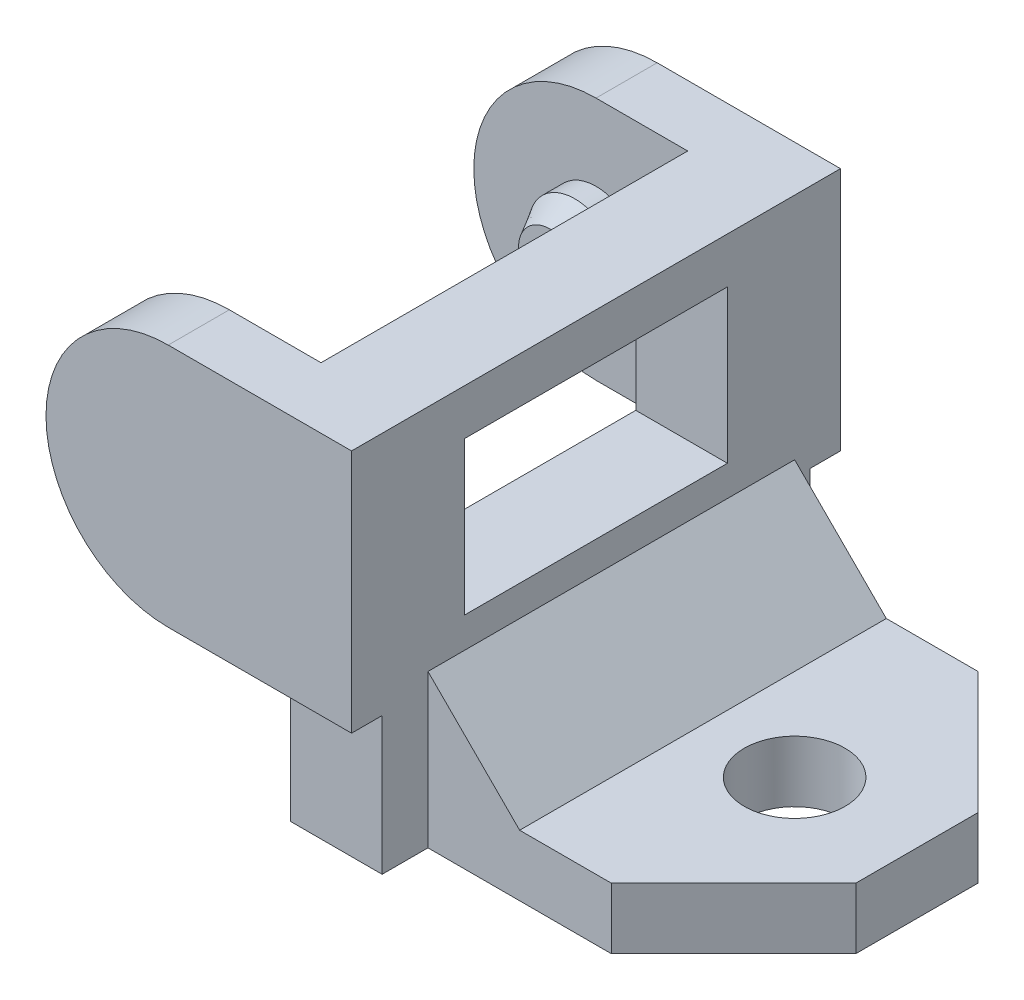
ISO-10303-21;
HEADER;
FILE_DESCRIPTION(('STEP AP214'),'2;1');
FILE_NAME('part.step','',(''),(''),'','','');
FILE_SCHEMA(('AUTOMOTIVE_DESIGN { 1 0 10303 214 1 1 1 1 }'));
ENDSEC;
DATA;
#1=APPLICATION_CONTEXT('core data for automotive mechanical design processes');
#2=APPLICATION_PROTOCOL_DEFINITION('international standard','automotive_design',2000,#1);
#3=PRODUCT_CONTEXT('',#1,'mechanical');
#4=PRODUCT('Part','Part','',(#3));
#5=PRODUCT_RELATED_PRODUCT_CATEGORY('part','',(#4));
#6=PRODUCT_DEFINITION_FORMATION('','',#4);
#7=PRODUCT_DEFINITION_CONTEXT('part definition',#1,'design');
#8=PRODUCT_DEFINITION('design','',#6,#7);
#9=PRODUCT_DEFINITION_SHAPE('','',#8);
#10=(LENGTH_UNIT() NAMED_UNIT(*) SI_UNIT(.MILLI.,.METRE.));
#11=(NAMED_UNIT(*) PLANE_ANGLE_UNIT() SI_UNIT($,.RADIAN.));
#12=(NAMED_UNIT(*) SI_UNIT($,.STERADIAN.) SOLID_ANGLE_UNIT());
#13=UNCERTAINTY_MEASURE_WITH_UNIT(LENGTH_MEASURE(1.E-05),#10,'distance_accuracy_value','');
#14=(GEOMETRIC_REPRESENTATION_CONTEXT(3) GLOBAL_UNCERTAINTY_ASSIGNED_CONTEXT((#13)) GLOBAL_UNIT_ASSIGNED_CONTEXT((#10,
#11,#12)) REPRESENTATION_CONTEXT('',''));
#15=CARTESIAN_POINT('',(0.,0.,0.));
#16=DIRECTION('',(0.,0.,1.));
#17=DIRECTION('',(1.,0.,0.));
#18=AXIS2_PLACEMENT_3D('',#15,#16,#17);
#19=CARTESIAN_POINT('',(2.,-8.,8.));
#20=DIRECTION('',(0.,1.,0.));
#21=DIRECTION('',(0.,0.,1.));
#22=AXIS2_PLACEMENT_3D('',#19,#20,#21);
#23=PLANE('',#22);
#24=DIRECTION('',(0.,0.,-1.));
#25=VECTOR('',#24,1.);
#26=CARTESIAN_POINT('',(-3.,-8.,7.));
#27=LINE('',#26,#25);
#28=CARTESIAN_POINT('',(-3.,-8.,7.));
#29=VERTEX_POINT('',#28);
#30=CARTESIAN_POINT('',(-3.,-8.,6.));
#31=VERTEX_POINT('',#30);
#32=EDGE_CURVE('E264',#29,#31,#27,.T.);
#33=ORIENTED_EDGE('',*,*,#32,.F.);
#34=DIRECTION('',(-1.,0.,0.));
#35=VECTOR('',#34,1.);
#36=CARTESIAN_POINT('',(0.,-8.,7.));
#37=LINE('',#36,#35);
#38=CARTESIAN_POINT('',(0.,-8.,7.));
#39=VERTEX_POINT('',#38);
#40=EDGE_CURVE('E237',#39,#29,#37,.T.);
#41=ORIENTED_EDGE('',*,*,#40,.F.);
#42=DIRECTION('',(0.,0.,1.));
#43=VECTOR('',#42,1.);
#44=CARTESIAN_POINT('',(0.,-8.,0.));
#45=LINE('',#44,#43);
#46=CARTESIAN_POINT('',(0.,-8.,8.));
#47=VERTEX_POINT('',#46);
#48=EDGE_CURVE('E307',#39,#47,#45,.T.);
#49=ORIENTED_EDGE('',*,*,#48,.T.);
#50=DIRECTION('',(1.,0.,0.));
#51=VECTOR('',#50,1.);
#52=CARTESIAN_POINT('',(2.,-8.,8.));
#53=LINE('',#52,#51);
#54=CARTESIAN_POINT('',(-6.,-8.,8.));
#55=VERTEX_POINT('',#54);
#56=EDGE_CURVE('E329',#55,#47,#53,.T.);
#57=ORIENTED_EDGE('',*,*,#56,.F.);
#58=DIRECTION('',(0.,0.,-1.));
#59=VECTOR('',#58,1.);
#60=CARTESIAN_POINT('',(-6.,-8.,8.));
#61=LINE('',#60,#59);
#62=CARTESIAN_POINT('',(-6.,-8.,6.));
#63=VERTEX_POINT('',#62);
#64=EDGE_CURVE('E346',#55,#63,#61,.T.);
#65=ORIENTED_EDGE('',*,*,#64,.T.);
#66=DIRECTION('',(-1.,0.,0.));
#67=VECTOR('',#66,1.);
#68=CARTESIAN_POINT('',(0.,-8.,6.));
#69=LINE('',#68,#67);
#70=EDGE_CURVE('E313',#31,#63,#69,.T.);
#71=ORIENTED_EDGE('',*,*,#70,.F.);
#72=EDGE_LOOP('',(#33,#41,#49,#57,#65,#71));
#73=FACE_BOUND('',#72,.T.);
#74=ADVANCED_FACE('F32',(#73),#23,.F.);
#75=CARTESIAN_POINT('',(-3.,-8.,-6.));
#76=VERTEX_POINT('',#75);
#77=CARTESIAN_POINT('',(-3.,-8.,-7.));
#78=VERTEX_POINT('',#77);
#79=EDGE_CURVE('E263',#76,#78,#27,.T.);
#80=ORIENTED_EDGE('',*,*,#79,.F.);
#81=DIRECTION('',(1.,0.,0.));
#82=VECTOR('',#81,1.);
#83=CARTESIAN_POINT('',(0.,-8.,-6.));
#84=LINE('',#83,#82);
#85=CARTESIAN_POINT('',(-6.,-8.,-6.));
#86=VERTEX_POINT('',#85);
#87=EDGE_CURVE('E310',#86,#76,#84,.T.);
#88=ORIENTED_EDGE('',*,*,#87,.F.);
#89=CARTESIAN_POINT('',(-6.,-8.,-8.));
#90=VERTEX_POINT('',#89);
#91=EDGE_CURVE('E345',#86,#90,#61,.T.);
#92=ORIENTED_EDGE('',*,*,#91,.T.);
#93=DIRECTION('',(1.,0.,0.));
#94=VECTOR('',#93,1.);
#95=CARTESIAN_POINT('',(2.,-8.,-8.));
#96=LINE('',#95,#94);
#97=CARTESIAN_POINT('',(0.,-8.,-8.));
#98=VERTEX_POINT('',#97);
#99=EDGE_CURVE('E338',#90,#98,#96,.T.);
#100=ORIENTED_EDGE('',*,*,#99,.T.);
#101=CARTESIAN_POINT('',(0.,-8.,-7.));
#102=VERTEX_POINT('',#101);
#103=EDGE_CURVE('E308',#98,#102,#45,.T.);
#104=ORIENTED_EDGE('',*,*,#103,.T.);
#105=DIRECTION('',(-1.,0.,0.));
#106=VECTOR('',#105,1.);
#107=CARTESIAN_POINT('',(0.,-8.,-7.));
#108=LINE('',#107,#106);
#109=EDGE_CURVE('E250',#102,#78,#108,.T.);
#110=ORIENTED_EDGE('',*,*,#109,.T.);
#111=EDGE_LOOP('',(#80,#88,#92,#100,#104,#110));
#112=FACE_BOUND('',#111,.T.);
#113=ADVANCED_FACE('F422',(#112),#23,.F.);
#114=CARTESIAN_POINT('',(-6.,-4.,8.));
#115=DIRECTION('',(0.,0.,-1.));
#116=DIRECTION('',(-1.,0.,0.));
#117=AXIS2_PLACEMENT_3D('',#114,#115,#116);
#118=CYLINDRICAL_SURFACE('',#117,4.);
#119=CARTESIAN_POINT('',(-6.,-4.,-6.));
#120=DIRECTION('',(0.,0.,1.));
#121=DIRECTION('',(1.,0.,0.));
#122=AXIS2_PLACEMENT_3D('',#119,#120,#121);
#123=CIRCLE('',#122,4.);
#124=CARTESIAN_POINT('',(-6.,0.,-6.));
#125=VERTEX_POINT('',#124);
#126=EDGE_CURVE('E323',#125,#86,#123,.T.);
#127=ORIENTED_EDGE('',*,*,#126,.F.);
#128=DIRECTION('',(0.,0.,-1.));
#129=VECTOR('',#128,1.);
#130=CARTESIAN_POINT('',(-6.,0.,8.));
#131=LINE('',#130,#129);
#132=CARTESIAN_POINT('',(-6.,0.,-8.));
#133=VERTEX_POINT('',#132);
#134=EDGE_CURVE('E335',#125,#133,#131,.T.);
#135=ORIENTED_EDGE('',*,*,#134,.T.);
#136=CARTESIAN_POINT('',(-6.,-4.,-8.));
#137=DIRECTION('',(0.,0.,1.));
#138=DIRECTION('',(1.,0.,0.));
#139=AXIS2_PLACEMENT_3D('',#136,#137,#138);
#140=CIRCLE('',#139,4.);
#141=EDGE_CURVE('E325',#133,#90,#140,.T.);
#142=ORIENTED_EDGE('',*,*,#141,.T.);
#143=ORIENTED_EDGE('',*,*,#91,.F.);
#144=EDGE_LOOP('',(#127,#135,#142,#143));
#145=FACE_BOUND('',#144,.T.);
#146=ADVANCED_FACE('F426',(#145),#118,.T.);
#147=CARTESIAN_POINT('',(-6.,0.,8.));
#148=VERTEX_POINT('',#147);
#149=CARTESIAN_POINT('',(-6.,0.,6.));
#150=VERTEX_POINT('',#149);
#151=EDGE_CURVE('E342',#148,#150,#131,.T.);
#152=ORIENTED_EDGE('',*,*,#151,.T.);
#153=CARTESIAN_POINT('',(-6.,-4.,6.));
#154=DIRECTION('',(0.,0.,-1.));
#155=DIRECTION('',(-1.,0.,0.));
#156=AXIS2_PLACEMENT_3D('',#153,#154,#155);
#157=CIRCLE('',#156,4.);
#158=EDGE_CURVE('E319',#63,#150,#157,.T.);
#159=ORIENTED_EDGE('',*,*,#158,.F.);
#160=ORIENTED_EDGE('',*,*,#64,.F.);
#161=CARTESIAN_POINT('',(-6.,-4.,8.));
#162=DIRECTION('',(0.,0.,1.));
#163=DIRECTION('',(1.,0.,0.));
#164=AXIS2_PLACEMENT_3D('',#161,#162,#163);
#165=CIRCLE('',#164,4.);
#166=EDGE_CURVE('E326',#148,#55,#165,.T.);
#167=ORIENTED_EDGE('',*,*,#166,.F.);
#168=EDGE_LOOP('',(#152,#159,#160,#167));
#169=FACE_BOUND('',#168,.T.);
#170=ADVANCED_FACE('F447',(#169),#118,.T.);
#171=CARTESIAN_POINT('',(-6.,0.,8.));
#172=DIRECTION('',(0.,-1.,0.));
#173=DIRECTION('',(1.,0.,0.));
#174=AXIS2_PLACEMENT_3D('',#171,#172,#173);
#175=PLANE('',#174);
#176=DIRECTION('',(-1.,0.,0.));
#177=VECTOR('',#176,1.);
#178=CARTESIAN_POINT('',(-6.,0.,8.));
#179=LINE('',#178,#177);
#180=CARTESIAN_POINT('',(0.,0.,8.));
#181=VERTEX_POINT('',#180);
#182=EDGE_CURVE('E333',#181,#148,#179,.T.);
#183=ORIENTED_EDGE('',*,*,#182,.F.);
#184=DIRECTION('',(0.,0.,-1.));
#185=VECTOR('',#184,1.);
#186=CARTESIAN_POINT('',(0.,0.,8.));
#187=LINE('',#186,#185);
#188=CARTESIAN_POINT('',(0.,0.,-8.));
#189=VERTEX_POINT('',#188);
#190=EDGE_CURVE('E356',#181,#189,#187,.T.);
#191=ORIENTED_EDGE('',*,*,#190,.T.);
#192=DIRECTION('',(-1.,0.,0.));
#193=VECTOR('',#192,1.);
#194=CARTESIAN_POINT('',(-6.,0.,-8.));
#195=LINE('',#194,#193);
#196=EDGE_CURVE('E330',#189,#133,#195,.T.);
#197=ORIENTED_EDGE('',*,*,#196,.T.);
#198=ORIENTED_EDGE('',*,*,#134,.F.);
#199=DIRECTION('',(-1.,0.,0.));
#200=VECTOR('',#199,1.);
#201=CARTESIAN_POINT('',(-6.,0.,-6.));
#202=LINE('',#201,#200);
#203=CARTESIAN_POINT('',(-3.,0.,-6.));
#204=VERTEX_POINT('',#203);
#205=EDGE_CURVE('E353',#204,#125,#202,.T.);
#206=ORIENTED_EDGE('',*,*,#205,.F.);
#207=DIRECTION('',(0.,0.,-1.));
#208=VECTOR('',#207,1.);
#209=CARTESIAN_POINT('',(-3.,0.,8.));
#210=LINE('',#209,#208);
#211=CARTESIAN_POINT('',(-3.,0.,6.));
#212=VERTEX_POINT('',#211);
#213=EDGE_CURVE('E351',#212,#204,#210,.T.);
#214=ORIENTED_EDGE('',*,*,#213,.F.);
#215=DIRECTION('',(1.,0.,0.));
#216=VECTOR('',#215,1.);
#217=CARTESIAN_POINT('',(-6.,0.,6.));
#218=LINE('',#217,#216);
#219=EDGE_CURVE('E349',#150,#212,#218,.T.);
#220=ORIENTED_EDGE('',*,*,#219,.F.);
#221=ORIENTED_EDGE('',*,*,#151,.F.);
#222=EDGE_LOOP('',(#183,#191,#197,#198,#206,#214,#220,#221));
#223=FACE_BOUND('',#222,.T.);
#224=ADVANCED_FACE('F432',(#223),#175,.F.);
#225=CARTESIAN_POINT('',(-6.,-4.,8.));
#226=DIRECTION('',(0.,0.,1.));
#227=DIRECTION('',(1.,0.,0.));
#228=AXIS2_PLACEMENT_3D('',#225,#226,#227);
#229=PLANE('',#228);
#230=DIRECTION('',(0.,1.,0.));
#231=VECTOR('',#230,1.);
#232=CARTESIAN_POINT('',(0.,-10.,8.));
#233=LINE('',#232,#231);
#234=EDGE_CURVE('E267',#47,#181,#233,.T.);
#235=ORIENTED_EDGE('',*,*,#234,.T.);
#236=ORIENTED_EDGE('',*,*,#182,.T.);
#237=ORIENTED_EDGE('',*,*,#166,.T.);
#238=ORIENTED_EDGE('',*,*,#56,.T.);
#239=EDGE_LOOP('',(#235,#236,#237,#238));
#240=FACE_BOUND('',#239,.T.);
#241=ADVANCED_FACE('F437',(#240),#229,.T.);
#242=CARTESIAN_POINT('',(-6.,-4.,-8.));
#243=DIRECTION('',(0.,0.,1.));
#244=DIRECTION('',(1.,0.,0.));
#245=AXIS2_PLACEMENT_3D('',#242,#243,#244);
#246=PLANE('',#245);
#247=ORIENTED_EDGE('',*,*,#196,.F.);
#248=DIRECTION('',(0.,1.,0.));
#249=VECTOR('',#248,1.);
#250=CARTESIAN_POINT('',(0.,-10.,-8.));
#251=LINE('',#250,#249);
#252=EDGE_CURVE('E268',#98,#189,#251,.T.);
#253=ORIENTED_EDGE('',*,*,#252,.F.);
#254=ORIENTED_EDGE('',*,*,#99,.F.);
#255=ORIENTED_EDGE('',*,*,#141,.F.);
#256=EDGE_LOOP('',(#247,#253,#254,#255));
#257=FACE_BOUND('',#256,.T.);
#258=ADVANCED_FACE('F420',(#257),#246,.F.);
#259=CARTESIAN_POINT('',(0.,-8.,-6.));
#260=DIRECTION('',(0.,0.,1.));
#261=DIRECTION('',(1.,0.,0.));
#262=AXIS2_PLACEMENT_3D('',#259,#260,#261);
#263=PLANE('',#262);
#264=CARTESIAN_POINT('',(-6.,-4.,-6.));
#265=DIRECTION('',(0.,0.,1.));
#266=DIRECTION('',(1.,0.,0.));
#267=AXIS2_PLACEMENT_3D('',#264,#265,#266);
#268=CIRCLE('',#267,1.5);
#269=CARTESIAN_POINT('',(-4.5,-4.,-6.));
#270=VERTEX_POINT('',#269);
#271=EDGE_CURVE('E358',#270,#270,#268,.T.);
#272=ORIENTED_EDGE('',*,*,#271,.F.);
#273=EDGE_LOOP('',(#272));
#274=FACE_BOUND('',#273,.T.);
#275=ORIENTED_EDGE('',*,*,#126,.T.);
#276=ORIENTED_EDGE('',*,*,#87,.T.);
#277=DIRECTION('',(0.,1.,0.));
#278=VECTOR('',#277,1.);
#279=CARTESIAN_POINT('',(-3.,-8.,-6.));
#280=LINE('',#279,#278);
#281=EDGE_CURVE('E316',#76,#204,#280,.T.);
#282=ORIENTED_EDGE('',*,*,#281,.T.);
#283=ORIENTED_EDGE('',*,*,#205,.T.);
#284=EDGE_LOOP('',(#275,#276,#282,#283));
#285=FACE_BOUND('',#284,.T.);
#286=ADVANCED_FACE('F459',(#274,#285),#263,.T.);
#287=CARTESIAN_POINT('',(-3.,-8.,0.));
#288=DIRECTION('',(-1.,0.,0.));
#289=DIRECTION('',(0.,0.,1.));
#290=AXIS2_PLACEMENT_3D('',#287,#288,#289);
#291=PLANE('',#290);
#292=DIRECTION('',(0.,1.,0.));
#293=VECTOR('',#292,1.);
#294=CARTESIAN_POINT('',(-3.,-8.,4.3));
#295=LINE('',#294,#293);
#296=CARTESIAN_POINT('',(-3.,-6.5,4.3));
#297=VERTEX_POINT('',#296);
#298=CARTESIAN_POINT('',(-3.,-1.5,4.3));
#299=VERTEX_POINT('',#298);
#300=EDGE_CURVE('E305',#297,#299,#295,.T.);
#301=ORIENTED_EDGE('',*,*,#300,.F.);
#302=DIRECTION('',(0.,0.,1.));
#303=VECTOR('',#302,1.);
#304=CARTESIAN_POINT('',(-3.,-6.5,0.));
#305=LINE('',#304,#303);
#306=CARTESIAN_POINT('',(-3.,-6.5,-4.3));
#307=VERTEX_POINT('',#306);
#308=EDGE_CURVE('E295',#307,#297,#305,.T.);
#309=ORIENTED_EDGE('',*,*,#308,.F.);
#310=DIRECTION('',(0.,-1.,0.));
#311=VECTOR('',#310,1.);
#312=CARTESIAN_POINT('',(-3.,-8.,-4.3));
#313=LINE('',#312,#311);
#314=CARTESIAN_POINT('',(-3.,-1.5,-4.3));
#315=VERTEX_POINT('',#314);
#316=EDGE_CURVE('E302',#315,#307,#313,.T.);
#317=ORIENTED_EDGE('',*,*,#316,.F.);
#318=DIRECTION('',(0.,0.,-1.));
#319=VECTOR('',#318,1.);
#320=CARTESIAN_POINT('',(-3.,-1.5,0.));
#321=LINE('',#320,#319);
#322=EDGE_CURVE('E300',#299,#315,#321,.T.);
#323=ORIENTED_EDGE('',*,*,#322,.F.);
#324=EDGE_LOOP('',(#301,#309,#317,#323));
#325=FACE_BOUND('',#324,.T.);
#326=ORIENTED_EDGE('',*,*,#213,.T.);
#327=ORIENTED_EDGE('',*,*,#281,.F.);
#328=ORIENTED_EDGE('',*,*,#79,.T.);
#329=DIRECTION('',(0.,-1.,0.));
#330=VECTOR('',#329,1.);
#331=CARTESIAN_POINT('',(-3.,-12.5,-7.));
#332=LINE('',#331,#330);
#333=CARTESIAN_POINT('',(-3.,-12.5,-7.));
#334=VERTEX_POINT('',#333);
#335=EDGE_CURVE('E252',#78,#334,#332,.T.);
#336=ORIENTED_EDGE('',*,*,#335,.T.);
#337=DIRECTION('',(0.,0.,-1.));
#338=VECTOR('',#337,1.);
#339=CARTESIAN_POINT('',(-3.,-12.5,7.));
#340=LINE('',#339,#338);
#341=CARTESIAN_POINT('',(-3.,-12.5,7.));
#342=VERTEX_POINT('',#341);
#343=EDGE_CURVE('E261',#342,#334,#340,.T.);
#344=ORIENTED_EDGE('',*,*,#343,.F.);
#345=DIRECTION('',(0.,-1.,0.));
#346=VECTOR('',#345,1.);
#347=CARTESIAN_POINT('',(-3.,-12.5,7.));
#348=LINE('',#347,#346);
#349=EDGE_CURVE('E240',#29,#342,#348,.T.);
#350=ORIENTED_EDGE('',*,*,#349,.F.);
#351=ORIENTED_EDGE('',*,*,#32,.T.);
#352=DIRECTION('',(0.,1.,0.));
#353=VECTOR('',#352,1.);
#354=CARTESIAN_POINT('',(-3.,-8.,6.));
#355=LINE('',#354,#353);
#356=EDGE_CURVE('E315',#31,#212,#355,.T.);
#357=ORIENTED_EDGE('',*,*,#356,.T.);
#358=EDGE_LOOP('',(#326,#327,#328,#336,#344,#350,#351,#357));
#359=FACE_BOUND('',#358,.T.);
#360=ADVANCED_FACE('F409',(#325,#359),#291,.T.);
#361=CARTESIAN_POINT('',(0.,-8.,6.));
#362=DIRECTION('',(0.,0.,-1.));
#363=DIRECTION('',(-1.,0.,0.));
#364=AXIS2_PLACEMENT_3D('',#361,#362,#363);
#365=PLANE('',#364);
#366=CARTESIAN_POINT('',(-6.,-4.,6.));
#367=DIRECTION('',(0.,0.,-1.));
#368=DIRECTION('',(-1.,0.,0.));
#369=AXIS2_PLACEMENT_3D('',#366,#367,#368);
#370=CIRCLE('',#369,1.5);
#371=CARTESIAN_POINT('',(-7.5,-4.,6.));
#372=VERTEX_POINT('',#371);
#373=EDGE_CURVE('E277',#372,#372,#370,.T.);
#374=ORIENTED_EDGE('',*,*,#373,.F.);
#375=EDGE_LOOP('',(#374));
#376=FACE_BOUND('',#375,.T.);
#377=ORIENTED_EDGE('',*,*,#158,.T.);
#378=ORIENTED_EDGE('',*,*,#219,.T.);
#379=ORIENTED_EDGE('',*,*,#356,.F.);
#380=ORIENTED_EDGE('',*,*,#70,.T.);
#381=EDGE_LOOP('',(#377,#378,#379,#380));
#382=FACE_BOUND('',#381,.T.);
#383=ADVANCED_FACE('F448',(#376,#382),#365,.T.);
#384=CARTESIAN_POINT('',(0.,-8.,0.));
#385=DIRECTION('',(-1.,0.,0.));
#386=DIRECTION('',(0.,0.,1.));
#387=AXIS2_PLACEMENT_3D('',#384,#385,#386);
#388=PLANE('',#387);
#389=DIRECTION('',(0.,1.,0.));
#390=VECTOR('',#389,1.);
#391=CARTESIAN_POINT('',(0.,-8.,-4.3));
#392=LINE('',#391,#390);
#393=CARTESIAN_POINT('',(0.,-6.5,-4.3));
#394=VERTEX_POINT('',#393);
#395=CARTESIAN_POINT('',(0.,-1.5,-4.3));
#396=VERTEX_POINT('',#395);
#397=EDGE_CURVE('E275',#394,#396,#392,.T.);
#398=ORIENTED_EDGE('',*,*,#397,.F.);
#399=DIRECTION('',(0.,0.,1.));
#400=VECTOR('',#399,1.);
#401=CARTESIAN_POINT('',(0.,-6.5,0.));
#402=LINE('',#401,#400);
#403=CARTESIAN_POINT('',(0.,-6.5,4.3));
#404=VERTEX_POINT('',#403);
#405=EDGE_CURVE('E284',#394,#404,#402,.T.);
#406=ORIENTED_EDGE('',*,*,#405,.T.);
#407=DIRECTION('',(0.,1.,0.));
#408=VECTOR('',#407,1.);
#409=CARTESIAN_POINT('',(0.,-8.,4.3));
#410=LINE('',#409,#408);
#411=CARTESIAN_POINT('',(0.,-1.5,4.3));
#412=VERTEX_POINT('',#411);
#413=EDGE_CURVE('E271',#404,#412,#410,.T.);
#414=ORIENTED_EDGE('',*,*,#413,.T.);
#415=DIRECTION('',(0.,0.,-1.));
#416=VECTOR('',#415,1.);
#417=CARTESIAN_POINT('',(0.,-1.5,0.));
#418=LINE('',#417,#416);
#419=EDGE_CURVE('E297',#412,#396,#418,.T.);
#420=ORIENTED_EDGE('',*,*,#419,.T.);
#421=EDGE_LOOP('',(#398,#406,#414,#420));
#422=FACE_BOUND('',#421,.T.);
#423=DIRECTION('',(0.,0.,-1.));
#424=VECTOR('',#423,1.);
#425=CARTESIAN_POINT('',(0.,-7.49999999999998,-6.5));
#426=LINE('',#425,#424);
#427=CARTESIAN_POINT('',(0.,-7.49999999999998,5.5));
#428=VERTEX_POINT('',#427);
#429=CARTESIAN_POINT('',(0.,-7.49999999999998,-6.5));
#430=VERTEX_POINT('',#429);
#431=EDGE_CURVE('E194',#428,#430,#426,.T.);
#432=ORIENTED_EDGE('',*,*,#431,.T.);
#433=DIRECTION('',(0.,1.,0.));
#434=VECTOR('',#433,1.);
#435=CARTESIAN_POINT('',(0.,-12.5,-6.5));
#436=LINE('',#435,#434);
#437=CARTESIAN_POINT('',(0.,-12.5,-6.5));
#438=VERTEX_POINT('',#437);
#439=EDGE_CURVE('E186',#438,#430,#436,.T.);
#440=ORIENTED_EDGE('',*,*,#439,.F.);
#441=DIRECTION('',(0.,0.,1.));
#442=VECTOR('',#441,1.);
#443=CARTESIAN_POINT('',(0.,-12.5,-6.5));
#444=LINE('',#443,#442);
#445=CARTESIAN_POINT('',(0.,-12.5,-7.));
#446=VERTEX_POINT('',#445);
#447=EDGE_CURVE('E191',#446,#438,#444,.T.);
#448=ORIENTED_EDGE('',*,*,#447,.F.);
#449=DIRECTION('',(0.,1.,0.));
#450=VECTOR('',#449,1.);
#451=CARTESIAN_POINT('',(0.,-8.,-7.));
#452=LINE('',#451,#450);
#453=EDGE_CURVE('E241',#446,#102,#452,.T.);
#454=ORIENTED_EDGE('',*,*,#453,.T.);
#455=ORIENTED_EDGE('',*,*,#103,.F.);
#456=ORIENTED_EDGE('',*,*,#252,.T.);
#457=ORIENTED_EDGE('',*,*,#190,.F.);
#458=ORIENTED_EDGE('',*,*,#234,.F.);
#459=ORIENTED_EDGE('',*,*,#48,.F.);
#460=DIRECTION('',(0.,1.,0.));
#461=VECTOR('',#460,1.);
#462=CARTESIAN_POINT('',(0.,-8.,7.));
#463=LINE('',#462,#461);
#464=CARTESIAN_POINT('',(0.,-12.5,7.));
#465=VERTEX_POINT('',#464);
#466=EDGE_CURVE('E246',#465,#39,#463,.T.);
#467=ORIENTED_EDGE('',*,*,#466,.F.);
#468=DIRECTION('',(0.,0.,1.));
#469=VECTOR('',#468,1.);
#470=CARTESIAN_POINT('',(0.,-12.5,8.));
#471=LINE('',#470,#469);
#472=CARTESIAN_POINT('',(0.,-12.5,5.5));
#473=VERTEX_POINT('',#472);
#474=EDGE_CURVE('E227',#473,#465,#471,.T.);
#475=ORIENTED_EDGE('',*,*,#474,.F.);
#476=DIRECTION('',(0.,1.,0.));
#477=VECTOR('',#476,1.);
#478=CARTESIAN_POINT('',(0.,-12.5,5.5));
#479=LINE('',#478,#477);
#480=EDGE_CURVE('E210',#473,#428,#479,.T.);
#481=ORIENTED_EDGE('',*,*,#480,.T.);
#482=EDGE_LOOP('',(#432,#440,#448,#454,#455,#456,#457,#458,#459,#467,#475,#481));
#483=FACE_BOUND('',#482,.T.);
#484=ADVANCED_FACE('F188',(#422,#483),#388,.F.);
#485=CARTESIAN_POINT('',(0.,-8.,-4.3));
#486=DIRECTION('',(0.,0.,-1.));
#487=DIRECTION('',(-1.,0.,0.));
#488=AXIS2_PLACEMENT_3D('',#485,#486,#487);
#489=PLANE('',#488);
#490=DIRECTION('',(1.,0.,0.));
#491=VECTOR('',#490,1.);
#492=CARTESIAN_POINT('',(-10.,-6.5,-4.29999999999999));
#493=LINE('',#492,#491);
#494=EDGE_CURVE('E288',#307,#394,#493,.T.);
#495=ORIENTED_EDGE('',*,*,#494,.T.);
#496=ORIENTED_EDGE('',*,*,#397,.T.);
#497=DIRECTION('',(1.,0.,0.));
#498=VECTOR('',#497,1.);
#499=CARTESIAN_POINT('',(-10.,-1.5,-4.3));
#500=LINE('',#499,#498);
#501=EDGE_CURVE('E285',#315,#396,#500,.T.);
#502=ORIENTED_EDGE('',*,*,#501,.F.);
#503=ORIENTED_EDGE('',*,*,#316,.T.);
#504=EDGE_LOOP('',(#495,#496,#502,#503));
#505=FACE_BOUND('',#504,.T.);
#506=ADVANCED_FACE('F456',(#505),#489,.F.);
#507=CARTESIAN_POINT('',(0.,-8.,4.3));
#508=DIRECTION('',(0.,0.,-1.));
#509=DIRECTION('',(-1.,0.,0.));
#510=AXIS2_PLACEMENT_3D('',#507,#508,#509);
#511=PLANE('',#510);
#512=ORIENTED_EDGE('',*,*,#413,.F.);
#513=DIRECTION('',(1.,0.,0.));
#514=VECTOR('',#513,1.);
#515=CARTESIAN_POINT('',(-10.,-6.5,4.3));
#516=LINE('',#515,#514);
#517=EDGE_CURVE('E280',#297,#404,#516,.T.);
#518=ORIENTED_EDGE('',*,*,#517,.F.);
#519=ORIENTED_EDGE('',*,*,#300,.T.);
#520=DIRECTION('',(1.,0.,0.));
#521=VECTOR('',#520,1.);
#522=CARTESIAN_POINT('',(-10.,-1.5,4.3));
#523=LINE('',#522,#521);
#524=EDGE_CURVE('E281',#299,#412,#523,.T.);
#525=ORIENTED_EDGE('',*,*,#524,.T.);
#526=EDGE_LOOP('',(#512,#518,#519,#525));
#527=FACE_BOUND('',#526,.T.);
#528=ADVANCED_FACE('F509',(#527),#511,.T.);
#529=CARTESIAN_POINT('',(-10.,-1.5,4.3));
#530=DIRECTION('',(0.,1.,0.));
#531=DIRECTION('',(0.,0.,1.));
#532=AXIS2_PLACEMENT_3D('',#529,#530,#531);
#533=PLANE('',#532);
#534=ORIENTED_EDGE('',*,*,#322,.T.);
#535=ORIENTED_EDGE('',*,*,#501,.T.);
#536=ORIENTED_EDGE('',*,*,#419,.F.);
#537=ORIENTED_EDGE('',*,*,#524,.F.);
#538=EDGE_LOOP('',(#534,#535,#536,#537));
#539=FACE_BOUND('',#538,.T.);
#540=ADVANCED_FACE('F506',(#539),#533,.F.);
#541=CARTESIAN_POINT('',(-10.,-6.5,4.3));
#542=DIRECTION('',(0.,-1.,0.));
#543=DIRECTION('',(0.,0.,-1.));
#544=AXIS2_PLACEMENT_3D('',#541,#542,#543);
#545=PLANE('',#544);
#546=ORIENTED_EDGE('',*,*,#308,.T.);
#547=ORIENTED_EDGE('',*,*,#517,.T.);
#548=ORIENTED_EDGE('',*,*,#405,.F.);
#549=ORIENTED_EDGE('',*,*,#494,.F.);
#550=EDGE_LOOP('',(#546,#547,#548,#549));
#551=FACE_BOUND('',#550,.T.);
#552=ADVANCED_FACE('F501',(#551),#545,.F.);
#553=CARTESIAN_POINT('',(-6.,-4.,4.5));
#554=DIRECTION('',(0.,0.,1.));
#555=DIRECTION('',(1.,0.,0.));
#556=AXIS2_PLACEMENT_3D('',#553,#554,#555);
#557=CYLINDRICAL_SURFACE('',#556,1.5);
#558=CARTESIAN_POINT('',(-6.,-4.,5.30000000000001));
#559=DIRECTION('',(0.,0.,-1.));
#560=DIRECTION('',(-1.,0.,0.));
#561=AXIS2_PLACEMENT_3D('',#558,#559,#560);
#562=CIRCLE('',#561,1.5);
#563=CARTESIAN_POINT('',(-7.5,-4.,5.30000000000001));
#564=VERTEX_POINT('',#563);
#565=EDGE_CURVE('E370',#564,#564,#562,.F.);
#566=ORIENTED_EDGE('',*,*,#565,.T.);
#567=EDGE_LOOP('',(#566));
#568=FACE_BOUND('',#567,.T.);
#569=ORIENTED_EDGE('',*,*,#373,.T.);
#570=EDGE_LOOP('',(#569));
#571=FACE_BOUND('',#570,.T.);
#572=ADVANCED_FACE('F493',(#568,#571),#557,.T.);
#573=CARTESIAN_POINT('',(-6.,-4.,4.5));
#574=DIRECTION('',(0.,0.,-1.));
#575=DIRECTION('',(-1.,0.,0.));
#576=AXIS2_PLACEMENT_3D('',#573,#574,#575);
#577=PLANE('',#576);
#578=CARTESIAN_POINT('',(-6.,-4.,4.5));
#579=DIRECTION('',(0.,0.,-1.));
#580=DIRECTION('',(-1.,0.,0.));
#581=AXIS2_PLACEMENT_3D('',#578,#579,#580);
#582=CIRCLE('',#581,1.0381197846483);
#583=CARTESIAN_POINT('',(-7.0381197846483,-4.,4.5));
#584=VERTEX_POINT('',#583);
#585=EDGE_CURVE('E367',#584,#584,#582,.T.);
#586=ORIENTED_EDGE('',*,*,#585,.T.);
#587=EDGE_LOOP('',(#586));
#588=FACE_BOUND('',#587,.T.);
#589=ADVANCED_FACE('F490',(#588),#577,.T.);
#590=CARTESIAN_POINT('',(-6.,-4.,-4.5));
#591=DIRECTION('',(0.,0.,-1.));
#592=DIRECTION('',(-1.,0.,0.));
#593=AXIS2_PLACEMENT_3D('',#590,#591,#592);
#594=CYLINDRICAL_SURFACE('',#593,1.5);
#595=CARTESIAN_POINT('',(-6.,-4.,-5.30000000000001));
#596=DIRECTION('',(0.,0.,1.));
#597=DIRECTION('',(1.,0.,0.));
#598=AXIS2_PLACEMENT_3D('',#595,#596,#597);
#599=CIRCLE('',#598,1.5);
#600=CARTESIAN_POINT('',(-4.5,-4.,-5.3));
#601=VERTEX_POINT('',#600);
#602=EDGE_CURVE('E361',#601,#601,#599,.F.);
#603=ORIENTED_EDGE('',*,*,#602,.T.);
#604=EDGE_LOOP('',(#603));
#605=FACE_BOUND('',#604,.T.);
#606=ORIENTED_EDGE('',*,*,#271,.T.);
#607=EDGE_LOOP('',(#606));
#608=FACE_BOUND('',#607,.T.);
#609=ADVANCED_FACE('F492',(#605,#608),#594,.T.);
#610=CARTESIAN_POINT('',(-6.,-4.,-4.5));
#611=DIRECTION('',(0.,0.,1.));
#612=DIRECTION('',(-1.,0.,0.));
#613=AXIS2_PLACEMENT_3D('',#610,#611,#612);
#614=PLANE('',#613);
#615=CARTESIAN_POINT('',(-6.,-4.,-4.5));
#616=DIRECTION('',(0.,0.,1.));
#617=DIRECTION('',(1.,0.,0.));
#618=AXIS2_PLACEMENT_3D('',#615,#616,#617);
#619=CIRCLE('',#618,1.0381197846483);
#620=CARTESIAN_POINT('',(-4.9618802153517,-4.,-4.5));
#621=VERTEX_POINT('',#620);
#622=EDGE_CURVE('E364',#621,#621,#619,.T.);
#623=ORIENTED_EDGE('',*,*,#622,.T.);
#624=EDGE_LOOP('',(#623));
#625=FACE_BOUND('',#624,.T.);
#626=ADVANCED_FACE('F477',(#625),#614,.T.);
#627=CARTESIAN_POINT('',(-6.,-4.,-5.3));
#628=DIRECTION('',(0.,0.,-1.));
#629=DIRECTION('',(-1.,0.,0.));
#630=AXIS2_PLACEMENT_3D('',#627,#628,#629);
#631=CONICAL_SURFACE('',#630,1.5,0.523598775598297);
#632=ORIENTED_EDGE('',*,*,#622,.F.);
#633=EDGE_LOOP('',(#632));
#634=FACE_BOUND('',#633,.T.);
#635=ORIENTED_EDGE('',*,*,#602,.F.);
#636=EDGE_LOOP('',(#635));
#637=FACE_BOUND('',#636,.T.);
#638=ADVANCED_FACE('F474',(#634,#637),#631,.T.);
#639=CARTESIAN_POINT('',(-6.,-4.,4.5));
#640=DIRECTION('',(0.,0.,1.));
#641=DIRECTION('',(1.,0.,0.));
#642=AXIS2_PLACEMENT_3D('',#639,#640,#641);
#643=CONICAL_SURFACE('',#642,1.0381197846483,0.523598775598297);
#644=ORIENTED_EDGE('',*,*,#565,.F.);
#645=EDGE_LOOP('',(#644));
#646=FACE_BOUND('',#645,.T.);
#647=ORIENTED_EDGE('',*,*,#585,.F.);
#648=EDGE_LOOP('',(#647));
#649=FACE_BOUND('',#648,.T.);
#650=ADVANCED_FACE('F476',(#646,#649),#643,.T.);
#651=CARTESIAN_POINT('',(10.,-12.5,7.));
#652=DIRECTION('',(0.,1.,0.));
#653=DIRECTION('',(-1.,0.,0.));
#654=AXIS2_PLACEMENT_3D('',#651,#652,#653);
#655=PLANE('',#654);
#656=CARTESIAN_POINT('',(6.,-12.5,-0.5));
#657=DIRECTION('',(0.,1.,0.));
#658=DIRECTION('',(-1.,0.,0.));
#659=AXIS2_PLACEMENT_3D('',#656,#657,#658);
#660=CIRCLE('',#659,1.65);
#661=CARTESIAN_POINT('',(4.35,-12.5,-0.5));
#662=VERTEX_POINT('',#661);
#663=EDGE_CURVE('E219',#662,#662,#660,.T.);
#664=ORIENTED_EDGE('',*,*,#663,.T.);
#665=EDGE_LOOP('',(#664));
#666=FACE_BOUND('',#665,.T.);
#667=DIRECTION('',(1.,0.,0.));
#668=VECTOR('',#667,1.);
#669=CARTESIAN_POINT('',(6.,-12.5,-6.5));
#670=LINE('',#669,#668);
#671=CARTESIAN_POINT('',(6.,-12.5,-6.5));
#672=VERTEX_POINT('',#671);
#673=EDGE_CURVE('E199',#438,#672,#670,.T.);
#674=ORIENTED_EDGE('',*,*,#673,.T.);
#675=DIRECTION('',(0.707106781186547,0.,0.707106781186548));
#676=VECTOR('',#675,1.);
#677=CARTESIAN_POINT('',(6.,-12.5,-6.5));
#678=LINE('',#677,#676);
#679=CARTESIAN_POINT('',(10.,-12.5,-2.5));
#680=VERTEX_POINT('',#679);
#681=EDGE_CURVE('E196',#672,#680,#678,.T.);
#682=ORIENTED_EDGE('',*,*,#681,.T.);
#683=DIRECTION('',(0.,0.,-1.));
#684=VECTOR('',#683,1.);
#685=CARTESIAN_POINT('',(10.,-12.5,7.));
#686=LINE('',#685,#684);
#687=CARTESIAN_POINT('',(10.,-12.5,1.5));
#688=VERTEX_POINT('',#687);
#689=EDGE_CURVE('E258',#688,#680,#686,.T.);
#690=ORIENTED_EDGE('',*,*,#689,.F.);
#691=DIRECTION('',(-0.707106781186547,0.,0.707106781186548));
#692=VECTOR('',#691,1.);
#693=CARTESIAN_POINT('',(10.,-12.5,1.5));
#694=LINE('',#693,#692);
#695=CARTESIAN_POINT('',(6.,-12.5,5.5));
#696=VERTEX_POINT('',#695);
#697=EDGE_CURVE('E221',#688,#696,#694,.T.);
#698=ORIENTED_EDGE('',*,*,#697,.T.);
#699=DIRECTION('',(-1.,0.,0.));
#700=VECTOR('',#699,1.);
#701=CARTESIAN_POINT('',(0.,-12.5,5.5));
#702=LINE('',#701,#700);
#703=EDGE_CURVE('E224',#696,#473,#702,.T.);
#704=ORIENTED_EDGE('',*,*,#703,.T.);
#705=ORIENTED_EDGE('',*,*,#474,.T.);
#706=DIRECTION('',(1.,0.,0.));
#707=VECTOR('',#706,1.);
#708=CARTESIAN_POINT('',(10.,-12.5,7.));
#709=LINE('',#708,#707);
#710=EDGE_CURVE('E243',#342,#465,#709,.T.);
#711=ORIENTED_EDGE('',*,*,#710,.F.);
#712=ORIENTED_EDGE('',*,*,#343,.T.);
#713=DIRECTION('',(1.,0.,0.));
#714=VECTOR('',#713,1.);
#715=CARTESIAN_POINT('',(10.,-12.5,-7.));
#716=LINE('',#715,#714);
#717=EDGE_CURVE('E209',#334,#446,#716,.T.);
#718=ORIENTED_EDGE('',*,*,#717,.T.);
#719=ORIENTED_EDGE('',*,*,#447,.T.);
#720=EDGE_LOOP('',(#674,#682,#690,#698,#704,#705,#711,#712,#718,#719));
#721=FACE_BOUND('',#720,.T.);
#722=ADVANCED_FACE('F206',(#666,#721),#655,.F.);
#723=CARTESIAN_POINT('',(10.,-10.5,7.));
#724=DIRECTION('',(-1.,0.,0.));
#725=DIRECTION('',(0.,0.,1.));
#726=AXIS2_PLACEMENT_3D('',#723,#724,#725);
#727=PLANE('',#726);
#728=ORIENTED_EDGE('',*,*,#689,.T.);
#729=DIRECTION('',(0.,1.,0.));
#730=VECTOR('',#729,1.);
#731=CARTESIAN_POINT('',(10.,-12.5,-2.5));
#732=LINE('',#731,#730);
#733=CARTESIAN_POINT('',(10.,-10.5,-2.5));
#734=VERTEX_POINT('',#733);
#735=EDGE_CURVE('E216',#680,#734,#732,.T.);
#736=ORIENTED_EDGE('',*,*,#735,.T.);
#737=DIRECTION('',(0.,0.,-1.));
#738=VECTOR('',#737,1.);
#739=CARTESIAN_POINT('',(10.,-10.5,7.));
#740=LINE('',#739,#738);
#741=CARTESIAN_POINT('',(10.,-10.5,1.5));
#742=VERTEX_POINT('',#741);
#743=EDGE_CURVE('E249',#742,#734,#740,.T.);
#744=ORIENTED_EDGE('',*,*,#743,.F.);
#745=DIRECTION('',(0.,1.,0.));
#746=VECTOR('',#745,1.);
#747=CARTESIAN_POINT('',(10.,-12.5,1.5));
#748=LINE('',#747,#746);
#749=EDGE_CURVE('E229',#688,#742,#748,.T.);
#750=ORIENTED_EDGE('',*,*,#749,.F.);
#751=EDGE_LOOP('',(#728,#736,#744,#750));
#752=FACE_BOUND('',#751,.T.);
#753=ADVANCED_FACE('F391',(#752),#727,.F.);
#754=CARTESIAN_POINT('',(0.,-10.5,7.));
#755=DIRECTION('',(0.,-1.,0.));
#756=DIRECTION('',(0.,0.,-1.));
#757=AXIS2_PLACEMENT_3D('',#754,#755,#756);
#758=PLANE('',#757);
#759=CARTESIAN_POINT('',(6.,-10.5,-0.5));
#760=DIRECTION('',(0.,-1.,0.));
#761=DIRECTION('',(0.,0.,-1.));
#762=AXIS2_PLACEMENT_3D('',#759,#760,#761);
#763=CIRCLE('',#762,1.65);
#764=CARTESIAN_POINT('',(6.,-10.5,-2.15));
#765=VERTEX_POINT('',#764);
#766=EDGE_CURVE('E236',#765,#765,#763,.T.);
#767=ORIENTED_EDGE('',*,*,#766,.T.);
#768=EDGE_LOOP('',(#767));
#769=FACE_BOUND('',#768,.T.);
#770=DIRECTION('',(-1.,0.,0.));
#771=VECTOR('',#770,1.);
#772=CARTESIAN_POINT('',(0.,-10.5,-6.5));
#773=LINE('',#772,#771);
#774=CARTESIAN_POINT('',(6.,-10.5,-6.5));
#775=VERTEX_POINT('',#774);
#776=CARTESIAN_POINT('',(2.99999999999999,-10.5,-6.5));
#777=VERTEX_POINT('',#776);
#778=EDGE_CURVE('E380',#775,#777,#773,.T.);
#779=ORIENTED_EDGE('',*,*,#778,.T.);
#780=DIRECTION('',(0.,0.,1.));
#781=VECTOR('',#780,1.);
#782=CARTESIAN_POINT('',(2.99999999999999,-10.5,5.5));
#783=LINE('',#782,#781);
#784=CARTESIAN_POINT('',(2.99999999999999,-10.5,5.5));
#785=VERTEX_POINT('',#784);
#786=EDGE_CURVE('E47',#777,#785,#783,.T.);
#787=ORIENTED_EDGE('',*,*,#786,.T.);
#788=DIRECTION('',(1.,0.,0.));
#789=VECTOR('',#788,1.);
#790=CARTESIAN_POINT('',(0.,-10.5,5.5));
#791=LINE('',#790,#789);
#792=CARTESIAN_POINT('',(6.,-10.5,5.5));
#793=VERTEX_POINT('',#792);
#794=EDGE_CURVE('E378',#785,#793,#791,.T.);
#795=ORIENTED_EDGE('',*,*,#794,.T.);
#796=DIRECTION('',(0.707106781186547,0.,-0.707106781186548));
#797=VECTOR('',#796,1.);
#798=CARTESIAN_POINT('',(2.25,-10.5,9.25));
#799=LINE('',#798,#797);
#800=EDGE_CURVE('E373',#793,#742,#799,.T.);
#801=ORIENTED_EDGE('',*,*,#800,.T.);
#802=ORIENTED_EDGE('',*,*,#743,.T.);
#803=DIRECTION('',(-0.707106781186547,0.,-0.707106781186548));
#804=VECTOR('',#803,1.);
#805=CARTESIAN_POINT('',(9.75,-10.5,-2.74999999999999));
#806=LINE('',#805,#804);
#807=EDGE_CURVE('E382',#734,#775,#806,.T.);
#808=ORIENTED_EDGE('',*,*,#807,.T.);
#809=EDGE_LOOP('',(#779,#787,#795,#801,#802,#808));
#810=FACE_BOUND('',#809,.T.);
#811=ADVANCED_FACE('F386',(#769,#810),#758,.F.);
#812=CARTESIAN_POINT('',(0.,0.,7.));
#813=DIRECTION('',(0.,0.,-1.));
#814=DIRECTION('',(-1.,0.,0.));
#815=AXIS2_PLACEMENT_3D('',#812,#813,#814);
#816=PLANE('',#815);
#817=ORIENTED_EDGE('',*,*,#710,.T.);
#818=ORIENTED_EDGE('',*,*,#466,.T.);
#819=ORIENTED_EDGE('',*,*,#40,.T.);
#820=ORIENTED_EDGE('',*,*,#349,.T.);
#821=EDGE_LOOP('',(#817,#818,#819,#820));
#822=FACE_BOUND('',#821,.T.);
#823=ADVANCED_FACE('F404',(#822),#816,.F.);
#824=CARTESIAN_POINT('',(0.,0.,-7.));
#825=DIRECTION('',(0.,0.,-1.));
#826=DIRECTION('',(-1.,0.,0.));
#827=AXIS2_PLACEMENT_3D('',#824,#825,#826);
#828=PLANE('',#827);
#829=ORIENTED_EDGE('',*,*,#453,.F.);
#830=ORIENTED_EDGE('',*,*,#717,.F.);
#831=ORIENTED_EDGE('',*,*,#335,.F.);
#832=ORIENTED_EDGE('',*,*,#109,.F.);
#833=EDGE_LOOP('',(#829,#830,#831,#832));
#834=FACE_BOUND('',#833,.T.);
#835=ADVANCED_FACE('F413',(#834),#828,.T.);
#836=CARTESIAN_POINT('',(6.,-12.5,-0.5));
#837=DIRECTION('',(0.,1.,0.));
#838=DIRECTION('',(-1.,0.,0.));
#839=AXIS2_PLACEMENT_3D('',#836,#837,#838);
#840=CYLINDRICAL_SURFACE('',#839,1.65);
#841=ORIENTED_EDGE('',*,*,#663,.F.);
#842=EDGE_LOOP('',(#841));
#843=FACE_BOUND('',#842,.T.);
#844=ORIENTED_EDGE('',*,*,#766,.F.);
#845=EDGE_LOOP('',(#844));
#846=FACE_BOUND('',#845,.T.);
#847=ADVANCED_FACE('F688',(#843,#846),#840,.F.);
#848=CARTESIAN_POINT('',(6.,-12.5,-6.5));
#849=DIRECTION('',(-0.707106781186548,0.,0.707106781186547));
#850=DIRECTION('',(0.707106781186547,0.,0.707106781186548));
#851=AXIS2_PLACEMENT_3D('',#848,#849,#850);
#852=PLANE('',#851);
#853=ORIENTED_EDGE('',*,*,#735,.F.);
#854=ORIENTED_EDGE('',*,*,#681,.F.);
#855=DIRECTION('',(0.,1.,0.));
#856=VECTOR('',#855,1.);
#857=CARTESIAN_POINT('',(6.,-12.5,-6.5));
#858=LINE('',#857,#856);
#859=EDGE_CURVE('E195',#672,#775,#858,.T.);
#860=ORIENTED_EDGE('',*,*,#859,.T.);
#861=ORIENTED_EDGE('',*,*,#807,.F.);
#862=EDGE_LOOP('',(#853,#854,#860,#861));
#863=FACE_BOUND('',#862,.T.);
#864=ADVANCED_FACE('F389',(#863),#852,.F.);
#865=CARTESIAN_POINT('',(6.,-12.5,-6.5));
#866=DIRECTION('',(0.,0.,1.));
#867=DIRECTION('',(1.,0.,0.));
#868=AXIS2_PLACEMENT_3D('',#865,#866,#867);
#869=PLANE('',#868);
#870=ORIENTED_EDGE('',*,*,#859,.F.);
#871=ORIENTED_EDGE('',*,*,#673,.F.);
#872=ORIENTED_EDGE('',*,*,#439,.T.);
#873=DIRECTION('',(-0.707106781186544,0.707106781186551,0.));
#874=VECTOR('',#873,1.);
#875=CARTESIAN_POINT('',(5.49999999999998,-13.,-6.5));
#876=LINE('',#875,#874);
#877=EDGE_CURVE('E40',#430,#777,#876,.F.);
#878=ORIENTED_EDGE('',*,*,#877,.T.);
#879=ORIENTED_EDGE('',*,*,#778,.F.);
#880=EDGE_LOOP('',(#870,#871,#872,#878,#879));
#881=FACE_BOUND('',#880,.T.);
#882=ADVANCED_FACE('F200',(#881),#869,.F.);
#883=CARTESIAN_POINT('',(0.,-12.5,5.5));
#884=DIRECTION('',(0.,0.,-1.));
#885=DIRECTION('',(-1.,0.,0.));
#886=AXIS2_PLACEMENT_3D('',#883,#884,#885);
#887=PLANE('',#886);
#888=ORIENTED_EDGE('',*,*,#480,.F.);
#889=ORIENTED_EDGE('',*,*,#703,.F.);
#890=DIRECTION('',(0.,1.,0.));
#891=VECTOR('',#890,1.);
#892=CARTESIAN_POINT('',(6.,-12.5,5.5));
#893=LINE('',#892,#891);
#894=EDGE_CURVE('E212',#696,#793,#893,.T.);
#895=ORIENTED_EDGE('',*,*,#894,.T.);
#896=ORIENTED_EDGE('',*,*,#794,.F.);
#897=DIRECTION('',(0.707106781186544,-0.707106781186551,0.));
#898=VECTOR('',#897,1.);
#899=CARTESIAN_POINT('',(2.50000000000001,-10.,5.5));
#900=LINE('',#899,#898);
#901=EDGE_CURVE('E11',#785,#428,#900,.F.);
#902=ORIENTED_EDGE('',*,*,#901,.T.);
#903=EDGE_LOOP('',(#888,#889,#895,#896,#902));
#904=FACE_BOUND('',#903,.T.);
#905=ADVANCED_FACE('F399',(#904),#887,.F.);
#906=CARTESIAN_POINT('',(10.,-12.5,1.5));
#907=DIRECTION('',(-0.707106781186548,0.,-0.707106781186547));
#908=DIRECTION('',(-0.707106781186547,0.,0.707106781186548));
#909=AXIS2_PLACEMENT_3D('',#906,#907,#908);
#910=PLANE('',#909);
#911=ORIENTED_EDGE('',*,*,#894,.F.);
#912=ORIENTED_EDGE('',*,*,#697,.F.);
#913=ORIENTED_EDGE('',*,*,#749,.T.);
#914=ORIENTED_EDGE('',*,*,#800,.F.);
#915=EDGE_LOOP('',(#911,#912,#913,#914));
#916=FACE_BOUND('',#915,.T.);
#917=ADVANCED_FACE('F396',(#916),#910,.F.);
#918=CARTESIAN_POINT('',(0.,-7.49999999999998,0.));
#919=DIRECTION('',(0.707106781186551,0.707106781186544,0.));
#920=DIRECTION('',(0.,0.,1.));
#921=AXIS2_PLACEMENT_3D('',#918,#919,#920);
#922=PLANE('',#921);
#923=ORIENTED_EDGE('',*,*,#901,.F.);
#924=ORIENTED_EDGE('',*,*,#786,.F.);
#925=ORIENTED_EDGE('',*,*,#877,.F.);
#926=ORIENTED_EDGE('',*,*,#431,.F.);
#927=EDGE_LOOP('',(#923,#924,#925,#926));
#928=FACE_BOUND('',#927,.T.);
#929=ADVANCED_FACE('F34',(#928),#922,.T.);
#930=CLOSED_SHELL('',(#74,#113,#146,#170,#224,#241,#258,#286,#360,#383,#484,#506,#528,#540,#552,
#572,#589,#609,#626,#638,#650,#722,#753,#811,#823,#835,#847,#864,#882,#905,#917,#929));
#931=MANIFOLD_SOLID_BREP('B2',#930);
#932=ADVANCED_BREP_SHAPE_REPRESENTATION('',(#18,#931),#14);
#933=SHAPE_DEFINITION_REPRESENTATION(#9,#932);
ENDSEC;
END-ISO-10303-21;
